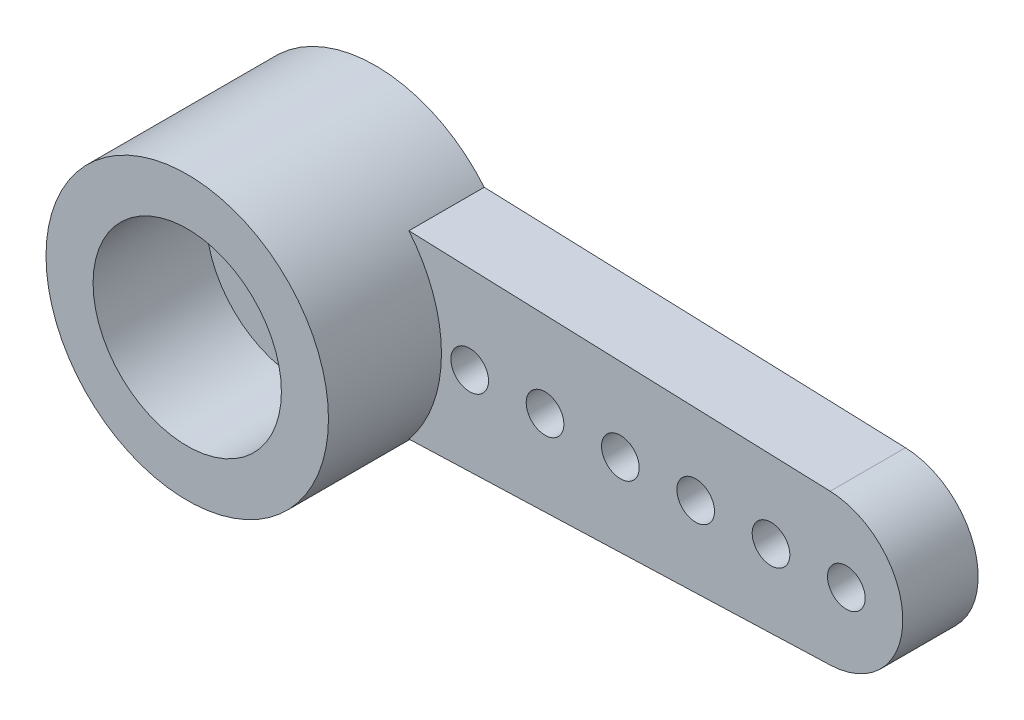
ISO-10303-21;
HEADER;
FILE_DESCRIPTION(('STEP AP214'),'2;1');
FILE_NAME('part.step','',(''),(''),'','','');
FILE_SCHEMA(('AUTOMOTIVE_DESIGN { 1 0 10303 214 1 1 1 1 }'));
ENDSEC;
DATA;
#1=APPLICATION_CONTEXT('core data for automotive mechanical design processes');
#2=APPLICATION_PROTOCOL_DEFINITION('international standard','automotive_design',2000,#1);
#3=PRODUCT_CONTEXT('',#1,'mechanical');
#4=PRODUCT('Part','Part','',(#3));
#5=PRODUCT_RELATED_PRODUCT_CATEGORY('part','',(#4));
#6=PRODUCT_DEFINITION_FORMATION('','',#4);
#7=PRODUCT_DEFINITION_CONTEXT('part definition',#1,'design');
#8=PRODUCT_DEFINITION('design','',#6,#7);
#9=PRODUCT_DEFINITION_SHAPE('','',#8);
#10=(LENGTH_UNIT() NAMED_UNIT(*) SI_UNIT(.MILLI.,.METRE.));
#11=(NAMED_UNIT(*) PLANE_ANGLE_UNIT() SI_UNIT($,.RADIAN.));
#12=(NAMED_UNIT(*) SI_UNIT($,.STERADIAN.) SOLID_ANGLE_UNIT());
#13=UNCERTAINTY_MEASURE_WITH_UNIT(LENGTH_MEASURE(1.E-05),#10,'distance_accuracy_value','');
#14=(GEOMETRIC_REPRESENTATION_CONTEXT(3) GLOBAL_UNCERTAINTY_ASSIGNED_CONTEXT((#13)) GLOBAL_UNIT_ASSIGNED_CONTEXT((#10,
#11,#12)) REPRESENTATION_CONTEXT('',''));
#15=CARTESIAN_POINT('',(0.,0.,0.));
#16=DIRECTION('',(0.,0.,1.));
#17=DIRECTION('',(1.,0.,0.));
#18=AXIS2_PLACEMENT_3D('',#15,#16,#17);
#19=CARTESIAN_POINT('',(0.,0.,0.));
#20=DIRECTION('',(0.,0.,1.));
#21=DIRECTION('',(1.,0.,0.));
#22=AXIS2_PLACEMENT_3D('',#19,#20,#21);
#23=CYLINDRICAL_SURFACE('',#22,2.5);
#24=CARTESIAN_POINT('',(0.,0.,5.));
#25=DIRECTION('',(0.,0.,1.));
#26=DIRECTION('',(1.,0.,0.));
#27=AXIS2_PLACEMENT_3D('',#24,#25,#26);
#28=CIRCLE('',#27,2.5);
#29=CARTESIAN_POINT('',(2.5,0.,5.));
#30=VERTEX_POINT('',#29);
#31=EDGE_CURVE('E236',#30,#30,#28,.T.);
#32=ORIENTED_EDGE('',*,*,#31,.T.);
#33=EDGE_LOOP('',(#32));
#34=FACE_BOUND('',#33,.T.);
#35=DIRECTION('',(0.,0.,-1.));
#36=VECTOR('',#35,1.);
#37=CARTESIAN_POINT('',(-0.233236000127276,2.48909641602021,2.));
#38=LINE('',#37,#36);
#39=CARTESIAN_POINT('',(-0.233236000127276,2.4890964160202,2.));
#40=VERTEX_POINT('',#39);
#41=CARTESIAN_POINT('',(-0.233236000127276,2.4890964160202,1.));
#42=VERTEX_POINT('',#41);
#43=EDGE_CURVE('E135',#40,#42,#38,.T.);
#44=ORIENTED_EDGE('',*,*,#43,.T.);
#45=CARTESIAN_POINT('',(0.,0.,1.));
#46=DIRECTION('',(0.,0.,-1.));
#47=DIRECTION('',(-1.,0.,0.));
#48=AXIS2_PLACEMENT_3D('',#45,#46,#47);
#49=CIRCLE('',#48,2.5);
#50=CARTESIAN_POINT('',(0.233236000127281,2.4890964160202,1.));
#51=VERTEX_POINT('',#50);
#52=EDGE_CURVE('E70',#42,#51,#49,.T.);
#53=ORIENTED_EDGE('',*,*,#52,.T.);
#54=DIRECTION('',(0.,0.,-1.));
#55=VECTOR('',#54,1.);
#56=CARTESIAN_POINT('',(0.233236000127275,2.48909641602021,2.));
#57=LINE('',#56,#55);
#58=CARTESIAN_POINT('',(0.233236000127275,2.4890964160202,2.));
#59=VERTEX_POINT('',#58);
#60=EDGE_CURVE('E132',#59,#51,#57,.T.);
#61=ORIENTED_EDGE('',*,*,#60,.F.);
#62=CARTESIAN_POINT('',(0.,0.,2.));
#63=DIRECTION('',(0.,0.,1.));
#64=DIRECTION('',(1.,0.,0.));
#65=AXIS2_PLACEMENT_3D('',#62,#63,#64);
#66=CIRCLE('',#65,2.5);
#67=CARTESIAN_POINT('',(0.233236000127268,-2.48909641602021,2.));
#68=VERTEX_POINT('',#67);
#69=EDGE_CURVE('E148',#68,#59,#66,.T.);
#70=ORIENTED_EDGE('',*,*,#69,.F.);
#71=DIRECTION('',(0.,0.,-1.));
#72=VECTOR('',#71,1.);
#73=CARTESIAN_POINT('',(0.233236000127268,-2.48909641602021,2.));
#74=LINE('',#73,#72);
#75=CARTESIAN_POINT('',(0.233236000127268,-2.48909641602021,1.));
#76=VERTEX_POINT('',#75);
#77=EDGE_CURVE('E139',#68,#76,#74,.T.);
#78=ORIENTED_EDGE('',*,*,#77,.T.);
#79=CARTESIAN_POINT('',(-0.233236000127282,-2.4890964160202,1.));
#80=VERTEX_POINT('',#79);
#81=EDGE_CURVE('E62',#76,#80,#49,.T.);
#82=ORIENTED_EDGE('',*,*,#81,.T.);
#83=DIRECTION('',(0.,0.,-1.));
#84=VECTOR('',#83,1.);
#85=CARTESIAN_POINT('',(-0.233236000127276,-2.48909641602021,2.));
#86=LINE('',#85,#84);
#87=CARTESIAN_POINT('',(-0.233236000127276,-2.4890964160202,2.));
#88=VERTEX_POINT('',#87);
#89=EDGE_CURVE('E166',#88,#80,#86,.T.);
#90=ORIENTED_EDGE('',*,*,#89,.F.);
#91=EDGE_CURVE('E164',#40,#88,#66,.T.);
#92=ORIENTED_EDGE('',*,*,#91,.F.);
#93=EDGE_LOOP('',(#44,#53,#61,#70,#78,#82,#90,#92));
#94=FACE_BOUND('',#93,.T.);
#95=ADVANCED_FACE('F47',(#34,#94),#23,.F.);
#96=CARTESIAN_POINT('',(-0.088385880769583,-2.49422934631706,2.));
#97=DIRECTION('',(0.0354139201848025,0.999372730394994,0.));
#98=DIRECTION('',(-0.999372730394994,0.0354139201848025,0.));
#99=AXIS2_PLACEMENT_3D('',#96,#97,#98);
#100=PLANE('',#99);
#101=DIRECTION('',(-0.999372730394994,0.0354139201848025,0.));
#102=VECTOR('',#101,1.);
#103=CARTESIAN_POINT('',(-0.088385880769583,-2.49422934631706,1.));
#104=LINE('',#103,#102);
#105=CARTESIAN_POINT('',(0.,-2.4973614014871,1.));
#106=VERTEX_POINT('',#105);
#107=EDGE_CURVE('E273',#106,#80,#104,.T.);
#108=ORIENTED_EDGE('',*,*,#107,.F.);
#109=DIRECTION('',(0.,0.,-1.));
#110=VECTOR('',#109,1.);
#111=CARTESIAN_POINT('',(0.,-2.4973614014871,2.));
#112=LINE('',#111,#110);
#113=CARTESIAN_POINT('',(0.,-2.4973614014871,2.));
#114=VERTEX_POINT('',#113);
#115=EDGE_CURVE('E143',#114,#106,#112,.T.);
#116=ORIENTED_EDGE('',*,*,#115,.F.);
#117=DIRECTION('',(0.999372730394994,-0.0354139201848025,0.));
#118=VECTOR('',#117,1.);
#119=CARTESIAN_POINT('',(-0.088385880769583,-2.49422934631706,2.));
#120=LINE('',#119,#118);
#121=EDGE_CURVE('E161',#88,#114,#120,.T.);
#122=ORIENTED_EDGE('',*,*,#121,.F.);
#123=ORIENTED_EDGE('',*,*,#89,.T.);
#124=EDGE_LOOP('',(#108,#116,#122,#123));
#125=FACE_BOUND('',#124,.T.);
#126=ADVANCED_FACE('F338',(#125),#100,.F.);
#127=CARTESIAN_POINT('',(0.0883858807695838,-2.49422934631706,2.));
#128=DIRECTION('',(0.0354139201848029,-0.999372730394994,0.));
#129=DIRECTION('',(0.999372730394994,0.0354139201848029,0.));
#130=AXIS2_PLACEMENT_3D('',#127,#128,#129);
#131=PLANE('',#130);
#132=ORIENTED_EDGE('',*,*,#115,.T.);
#133=DIRECTION('',(0.999372730394994,0.0354139201848029,0.));
#134=VECTOR('',#133,1.);
#135=CARTESIAN_POINT('',(0.0883858807695838,-2.49422934631706,1.));
#136=LINE('',#135,#134);
#137=EDGE_CURVE('E127',#106,#76,#136,.T.);
#138=ORIENTED_EDGE('',*,*,#137,.T.);
#139=ORIENTED_EDGE('',*,*,#77,.F.);
#140=DIRECTION('',(-0.999372730394994,-0.0354139201848029,0.));
#141=VECTOR('',#140,1.);
#142=CARTESIAN_POINT('',(0.0883858807695838,-2.49422934631706,2.));
#143=LINE('',#142,#141);
#144=EDGE_CURVE('E154',#68,#114,#143,.T.);
#145=ORIENTED_EDGE('',*,*,#144,.T.);
#146=EDGE_LOOP('',(#132,#138,#139,#145));
#147=FACE_BOUND('',#146,.T.);
#148=ADVANCED_FACE('F344',(#147),#131,.T.);
#149=CARTESIAN_POINT('',(0.0883858807695825,2.49422934631706,2.));
#150=DIRECTION('',(-0.0354139201848023,-0.999372730394994,0.));
#151=DIRECTION('',(0.999372730394994,-0.0354139201848023,0.));
#152=AXIS2_PLACEMENT_3D('',#149,#150,#151);
#153=PLANE('',#152);
#154=DIRECTION('',(0.999372730394994,-0.0354139201848023,0.));
#155=VECTOR('',#154,1.);
#156=CARTESIAN_POINT('',(0.0883858807695825,2.49422934631706,1.));
#157=LINE('',#156,#155);
#158=CARTESIAN_POINT('',(0.,2.4973614014871,1.));
#159=VERTEX_POINT('',#158);
#160=EDGE_CURVE('E121',#159,#51,#157,.T.);
#161=ORIENTED_EDGE('',*,*,#160,.F.);
#162=DIRECTION('',(0.,0.,-1.));
#163=VECTOR('',#162,1.);
#164=CARTESIAN_POINT('',(0.,2.4973614014871,2.));
#165=LINE('',#164,#163);
#166=CARTESIAN_POINT('',(0.,2.4973614014871,2.));
#167=VERTEX_POINT('',#166);
#168=EDGE_CURVE('E140',#167,#159,#165,.T.);
#169=ORIENTED_EDGE('',*,*,#168,.F.);
#170=DIRECTION('',(-0.999372730394994,0.0354139201848023,0.));
#171=VECTOR('',#170,1.);
#172=CARTESIAN_POINT('',(0.0883858807695825,2.49422934631706,2.));
#173=LINE('',#172,#171);
#174=EDGE_CURVE('E138',#59,#167,#173,.T.);
#175=ORIENTED_EDGE('',*,*,#174,.F.);
#176=ORIENTED_EDGE('',*,*,#60,.T.);
#177=EDGE_LOOP('',(#161,#169,#175,#176));
#178=FACE_BOUND('',#177,.T.);
#179=ADVANCED_FACE('F137',(#178),#153,.F.);
#180=CARTESIAN_POINT('',(-0.088385880769583,2.49422934631706,2.));
#181=DIRECTION('',(-0.0354139201848025,0.999372730394994,0.));
#182=DIRECTION('',(-0.999372730394994,-0.0354139201848025,0.));
#183=AXIS2_PLACEMENT_3D('',#180,#181,#182);
#184=PLANE('',#183);
#185=ORIENTED_EDGE('',*,*,#168,.T.);
#186=DIRECTION('',(-0.999372730394994,-0.0354139201848025,0.));
#187=VECTOR('',#186,1.);
#188=CARTESIAN_POINT('',(-0.088385880769583,2.49422934631706,1.));
#189=LINE('',#188,#187);
#190=EDGE_CURVE('E12',#159,#42,#189,.T.);
#191=ORIENTED_EDGE('',*,*,#190,.T.);
#192=ORIENTED_EDGE('',*,*,#43,.F.);
#193=DIRECTION('',(0.999372730394994,0.0354139201848026,0.));
#194=VECTOR('',#193,1.);
#195=CARTESIAN_POINT('',(-0.088385880769583,2.49422934631706,2.));
#196=LINE('',#195,#194);
#197=EDGE_CURVE('E153',#40,#167,#196,.T.);
#198=ORIENTED_EDGE('',*,*,#197,.T.);
#199=EDGE_LOOP('',(#185,#191,#192,#198));
#200=FACE_BOUND('',#199,.T.);
#201=ADVANCED_FACE('F366',(#200),#184,.T.);
#202=CARTESIAN_POINT('',(0.,0.,2.));
#203=DIRECTION('',(0.,0.,1.));
#204=DIRECTION('',(1.,0.,0.));
#205=AXIS2_PLACEMENT_3D('',#202,#203,#204);
#206=PLANE('',#205);
#207=CARTESIAN_POINT('',(0.,0.,2.));
#208=DIRECTION('',(0.,0.,1.));
#209=DIRECTION('',(1.,0.,0.));
#210=AXIS2_PLACEMENT_3D('',#207,#208,#209);
#211=CIRCLE('',#210,1.25);
#212=CARTESIAN_POINT('',(1.25,0.,2.));
#213=VERTEX_POINT('',#212);
#214=EDGE_CURVE('E282',#213,#213,#211,.T.);
#215=ORIENTED_EDGE('',*,*,#214,.F.);
#216=EDGE_LOOP('',(#215));
#217=FACE_BOUND('',#216,.T.);
#218=ORIENTED_EDGE('',*,*,#197,.F.);
#219=ORIENTED_EDGE('',*,*,#91,.T.);
#220=ORIENTED_EDGE('',*,*,#121,.T.);
#221=ORIENTED_EDGE('',*,*,#144,.F.);
#222=ORIENTED_EDGE('',*,*,#69,.T.);
#223=ORIENTED_EDGE('',*,*,#174,.T.);
#224=EDGE_LOOP('',(#218,#219,#220,#221,#222,#223));
#225=FACE_BOUND('',#224,.T.);
#226=ADVANCED_FACE('F354',(#217,#225),#206,.T.);
#227=CARTESIAN_POINT('',(0.0883858807695838,-2.49422934631706,2.));
#228=DIRECTION('',(0.0354139201848029,-0.999372730394994,0.));
#229=DIRECTION('',(0.999372730394994,0.0354139201848029,0.));
#230=AXIS2_PLACEMENT_3D('',#227,#228,#229);
#231=PLANE('',#230);
#232=DIRECTION('',(-0.999372730394994,-0.0354139201848029,0.));
#233=VECTOR('',#232,1.);
#234=CARTESIAN_POINT('',(0.0883858807695838,-2.49422934631706,0.));
#235=LINE('',#234,#233);
#236=CARTESIAN_POINT('',(14.0708278403696,-1.99874546078998,0.));
#237=VERTEX_POINT('',#236);
#238=CARTESIAN_POINT('',(2.88547071027724,-2.39511143376089,0.));
#239=VERTEX_POINT('',#238);
#240=EDGE_CURVE('E202',#237,#239,#235,.T.);
#241=ORIENTED_EDGE('',*,*,#240,.F.);
#242=DIRECTION('',(0.,0.,-1.));
#243=VECTOR('',#242,1.);
#244=CARTESIAN_POINT('',(14.0708278403696,-1.99874546078998,2.));
#245=LINE('',#244,#243);
#246=CARTESIAN_POINT('',(14.0708278403696,-1.99874546078998,2.));
#247=VERTEX_POINT('',#246);
#248=EDGE_CURVE('E173',#247,#237,#245,.T.);
#249=ORIENTED_EDGE('',*,*,#248,.F.);
#250=DIRECTION('',(-0.999372730394994,-0.0354139201848029,0.));
#251=VECTOR('',#250,1.);
#252=CARTESIAN_POINT('',(0.0883858807695838,-2.49422934631706,2.));
#253=LINE('',#252,#251);
#254=CARTESIAN_POINT('',(2.88547071027724,-2.39511143376089,2.));
#255=VERTEX_POINT('',#254);
#256=EDGE_CURVE('E188',#247,#255,#253,.T.);
#257=ORIENTED_EDGE('',*,*,#256,.T.);
#258=DIRECTION('',(0.,0.,-1.));
#259=VECTOR('',#258,1.);
#260=CARTESIAN_POINT('',(2.88547071027724,-2.39511143376089,2.));
#261=LINE('',#260,#259);
#262=EDGE_CURVE('E181',#255,#239,#261,.T.);
#263=ORIENTED_EDGE('',*,*,#262,.T.);
#264=EDGE_LOOP('',(#241,#249,#257,#263));
#265=FACE_BOUND('',#264,.T.);
#266=ADVANCED_FACE('F49',(#265),#231,.T.);
#267=CARTESIAN_POINT('',(14.,0.,2.));
#268=DIRECTION('',(0.,0.,-1.));
#269=DIRECTION('',(-1.,0.,0.));
#270=AXIS2_PLACEMENT_3D('',#267,#268,#269);
#271=CYLINDRICAL_SURFACE('',#270,2.);
#272=CARTESIAN_POINT('',(14.,0.,0.));
#273=DIRECTION('',(0.,0.,1.));
#274=DIRECTION('',(1.,0.,0.));
#275=AXIS2_PLACEMENT_3D('',#272,#273,#274);
#276=CIRCLE('',#275,2.);
#277=CARTESIAN_POINT('',(14.0708278403696,1.99874546078999,0.));
#278=VERTEX_POINT('',#277);
#279=EDGE_CURVE('E197',#237,#278,#276,.T.);
#280=ORIENTED_EDGE('',*,*,#279,.T.);
#281=DIRECTION('',(0.,0.,-1.));
#282=VECTOR('',#281,1.);
#283=CARTESIAN_POINT('',(14.0708278403696,1.99874546078999,2.));
#284=LINE('',#283,#282);
#285=CARTESIAN_POINT('',(14.0708278403696,1.99874546078999,2.));
#286=VERTEX_POINT('',#285);
#287=EDGE_CURVE('E205',#286,#278,#284,.T.);
#288=ORIENTED_EDGE('',*,*,#287,.F.);
#289=CARTESIAN_POINT('',(14.,0.,2.));
#290=DIRECTION('',(0.,0.,1.));
#291=DIRECTION('',(1.,0.,0.));
#292=AXIS2_PLACEMENT_3D('',#289,#290,#291);
#293=CIRCLE('',#292,2.);
#294=EDGE_CURVE('E190',#247,#286,#293,.T.);
#295=ORIENTED_EDGE('',*,*,#294,.F.);
#296=ORIENTED_EDGE('',*,*,#248,.T.);
#297=EDGE_LOOP('',(#280,#288,#295,#296));
#298=FACE_BOUND('',#297,.T.);
#299=ADVANCED_FACE('F357',(#298),#271,.T.);
#300=CARTESIAN_POINT('',(0.0883858807695825,2.49422934631706,2.));
#301=DIRECTION('',(-0.0354139201848023,-0.999372730394994,0.));
#302=DIRECTION('',(0.999372730394994,-0.0354139201848023,0.));
#303=AXIS2_PLACEMENT_3D('',#300,#301,#302);
#304=PLANE('',#303);
#305=DIRECTION('',(-0.999372730394994,0.0354139201848023,0.));
#306=VECTOR('',#305,1.);
#307=CARTESIAN_POINT('',(0.0883858807695825,2.49422934631706,0.));
#308=LINE('',#307,#306);
#309=CARTESIAN_POINT('',(2.88547071027724,2.39511143376089,0.));
#310=VERTEX_POINT('',#309);
#311=EDGE_CURVE('E191',#278,#310,#308,.T.);
#312=ORIENTED_EDGE('',*,*,#311,.T.);
#313=DIRECTION('',(0.,0.,-1.));
#314=VECTOR('',#313,1.);
#315=CARTESIAN_POINT('',(2.88547071027724,2.39511143376089,2.));
#316=LINE('',#315,#314);
#317=CARTESIAN_POINT('',(2.88547071027724,2.39511143376089,2.));
#318=VERTEX_POINT('',#317);
#319=EDGE_CURVE('E184',#318,#310,#316,.T.);
#320=ORIENTED_EDGE('',*,*,#319,.F.);
#321=DIRECTION('',(-0.999372730394994,0.0354139201848023,0.));
#322=VECTOR('',#321,1.);
#323=CARTESIAN_POINT('',(0.0883858807695825,2.49422934631706,2.));
#324=LINE('',#323,#322);
#325=EDGE_CURVE('E185',#286,#318,#324,.T.);
#326=ORIENTED_EDGE('',*,*,#325,.F.);
#327=ORIENTED_EDGE('',*,*,#287,.T.);
#328=EDGE_LOOP('',(#312,#320,#326,#327));
#329=FACE_BOUND('',#328,.T.);
#330=ADVANCED_FACE('F352',(#329),#304,.F.);
#331=CARTESIAN_POINT('',(12.5,0.,2.));
#332=DIRECTION('',(0.,0.,-1.));
#333=DIRECTION('',(-1.,0.,0.));
#334=AXIS2_PLACEMENT_3D('',#331,#332,#333);
#335=CIRCLE('',#334,0.500000000000001);
#336=CARTESIAN_POINT('',(12.,0.,2.));
#337=VERTEX_POINT('',#336);
#338=EDGE_CURVE('E270',#337,#337,#335,.T.);
#339=ORIENTED_EDGE('',*,*,#338,.T.);
#340=EDGE_LOOP('',(#339));
#341=FACE_BOUND('',#340,.T.);
#342=CARTESIAN_POINT('',(4.5,0.,2.));
#343=DIRECTION('',(0.,0.,-1.));
#344=DIRECTION('',(-1.,0.,0.));
#345=AXIS2_PLACEMENT_3D('',#342,#343,#344);
#346=CIRCLE('',#345,0.500000000000001);
#347=CARTESIAN_POINT('',(4.,0.,2.));
#348=VERTEX_POINT('',#347);
#349=EDGE_CURVE('E264',#348,#348,#346,.T.);
#350=ORIENTED_EDGE('',*,*,#349,.T.);
#351=EDGE_LOOP('',(#350));
#352=FACE_BOUND('',#351,.T.);
#353=CARTESIAN_POINT('',(6.5,0.,2.));
#354=DIRECTION('',(0.,0.,-1.));
#355=DIRECTION('',(-1.,0.,0.));
#356=AXIS2_PLACEMENT_3D('',#353,#354,#355);
#357=CIRCLE('',#356,0.500000000000001);
#358=CARTESIAN_POINT('',(6.,0.,2.));
#359=VERTEX_POINT('',#358);
#360=EDGE_CURVE('E258',#359,#359,#357,.T.);
#361=ORIENTED_EDGE('',*,*,#360,.T.);
#362=EDGE_LOOP('',(#361));
#363=FACE_BOUND('',#362,.T.);
#364=CARTESIAN_POINT('',(8.5,0.,2.));
#365=DIRECTION('',(0.,0.,-1.));
#366=DIRECTION('',(-1.,0.,0.));
#367=AXIS2_PLACEMENT_3D('',#364,#365,#366);
#368=CIRCLE('',#367,0.500000000000001);
#369=CARTESIAN_POINT('',(8.,0.,2.));
#370=VERTEX_POINT('',#369);
#371=EDGE_CURVE('E252',#370,#370,#368,.T.);
#372=ORIENTED_EDGE('',*,*,#371,.T.);
#373=EDGE_LOOP('',(#372));
#374=FACE_BOUND('',#373,.T.);
#375=CARTESIAN_POINT('',(10.5,0.,2.));
#376=DIRECTION('',(0.,0.,-1.));
#377=DIRECTION('',(-1.,0.,0.));
#378=AXIS2_PLACEMENT_3D('',#375,#376,#377);
#379=CIRCLE('',#378,0.500000000000001);
#380=CARTESIAN_POINT('',(10.,0.,2.));
#381=VERTEX_POINT('',#380);
#382=EDGE_CURVE('E246',#381,#381,#379,.T.);
#383=ORIENTED_EDGE('',*,*,#382,.T.);
#384=EDGE_LOOP('',(#383));
#385=FACE_BOUND('',#384,.T.);
#386=CARTESIAN_POINT('',(14.5,0.,2.));
#387=DIRECTION('',(0.,0.,-1.));
#388=DIRECTION('',(-1.,0.,0.));
#389=AXIS2_PLACEMENT_3D('',#386,#387,#388);
#390=CIRCLE('',#389,0.500000000000001);
#391=CARTESIAN_POINT('',(14.,0.,2.));
#392=VERTEX_POINT('',#391);
#393=EDGE_CURVE('E239',#392,#392,#390,.T.);
#394=ORIENTED_EDGE('',*,*,#393,.T.);
#395=EDGE_LOOP('',(#394));
#396=FACE_BOUND('',#395,.T.);
#397=CARTESIAN_POINT('',(0.,0.,2.));
#398=DIRECTION('',(0.,0.,1.));
#399=DIRECTION('',(1.,0.,0.));
#400=AXIS2_PLACEMENT_3D('',#397,#398,#399);
#401=CIRCLE('',#400,3.75);
#402=EDGE_CURVE('E55',#255,#318,#401,.T.);
#403=ORIENTED_EDGE('',*,*,#402,.F.);
#404=ORIENTED_EDGE('',*,*,#256,.F.);
#405=ORIENTED_EDGE('',*,*,#294,.T.);
#406=ORIENTED_EDGE('',*,*,#325,.T.);
#407=EDGE_LOOP('',(#403,#404,#405,#406));
#408=FACE_BOUND('',#407,.T.);
#409=ADVANCED_FACE('F218',(#341,#352,#363,#374,#385,#396,#408),#206,.T.);
#410=CARTESIAN_POINT('',(0.,0.,0.));
#411=DIRECTION('',(0.,0.,1.));
#412=DIRECTION('',(1.,0.,0.));
#413=AXIS2_PLACEMENT_3D('',#410,#411,#412);
#414=PLANE('',#413);
#415=CARTESIAN_POINT('',(0.,0.,0.));
#416=DIRECTION('',(0.,0.,-1.));
#417=DIRECTION('',(-1.,0.,0.));
#418=AXIS2_PLACEMENT_3D('',#415,#416,#417);
#419=CIRCLE('',#418,2.5);
#420=CARTESIAN_POINT('',(-2.5,0.,0.));
#421=VERTEX_POINT('',#420);
#422=EDGE_CURVE('E278',#421,#421,#419,.T.);
#423=ORIENTED_EDGE('',*,*,#422,.F.);
#424=EDGE_LOOP('',(#423));
#425=FACE_BOUND('',#424,.T.);
#426=CARTESIAN_POINT('',(12.5,0.,0.));
#427=DIRECTION('',(0.,0.,-1.));
#428=DIRECTION('',(-1.,0.,0.));
#429=AXIS2_PLACEMENT_3D('',#426,#427,#428);
#430=CIRCLE('',#429,0.500000000000001);
#431=CARTESIAN_POINT('',(12.,0.,0.));
#432=VERTEX_POINT('',#431);
#433=EDGE_CURVE('E267',#432,#432,#430,.T.);
#434=ORIENTED_EDGE('',*,*,#433,.F.);
#435=EDGE_LOOP('',(#434));
#436=FACE_BOUND('',#435,.T.);
#437=CARTESIAN_POINT('',(4.5,0.,0.));
#438=DIRECTION('',(0.,0.,-1.));
#439=DIRECTION('',(-1.,0.,0.));
#440=AXIS2_PLACEMENT_3D('',#437,#438,#439);
#441=CIRCLE('',#440,0.500000000000001);
#442=CARTESIAN_POINT('',(4.,0.,0.));
#443=VERTEX_POINT('',#442);
#444=EDGE_CURVE('E261',#443,#443,#441,.T.);
#445=ORIENTED_EDGE('',*,*,#444,.F.);
#446=EDGE_LOOP('',(#445));
#447=FACE_BOUND('',#446,.T.);
#448=CARTESIAN_POINT('',(6.5,0.,0.));
#449=DIRECTION('',(0.,0.,-1.));
#450=DIRECTION('',(-1.,0.,0.));
#451=AXIS2_PLACEMENT_3D('',#448,#449,#450);
#452=CIRCLE('',#451,0.500000000000001);
#453=CARTESIAN_POINT('',(6.,0.,0.));
#454=VERTEX_POINT('',#453);
#455=EDGE_CURVE('E255',#454,#454,#452,.T.);
#456=ORIENTED_EDGE('',*,*,#455,.F.);
#457=EDGE_LOOP('',(#456));
#458=FACE_BOUND('',#457,.T.);
#459=CARTESIAN_POINT('',(8.5,0.,0.));
#460=DIRECTION('',(0.,0.,-1.));
#461=DIRECTION('',(-1.,0.,0.));
#462=AXIS2_PLACEMENT_3D('',#459,#460,#461);
#463=CIRCLE('',#462,0.500000000000001);
#464=CARTESIAN_POINT('',(8.,0.,0.));
#465=VERTEX_POINT('',#464);
#466=EDGE_CURVE('E249',#465,#465,#463,.T.);
#467=ORIENTED_EDGE('',*,*,#466,.F.);
#468=EDGE_LOOP('',(#467));
#469=FACE_BOUND('',#468,.T.);
#470=CARTESIAN_POINT('',(10.5,0.,0.));
#471=DIRECTION('',(0.,0.,-1.));
#472=DIRECTION('',(-1.,0.,0.));
#473=AXIS2_PLACEMENT_3D('',#470,#471,#472);
#474=CIRCLE('',#473,0.500000000000001);
#475=CARTESIAN_POINT('',(10.,0.,0.));
#476=VERTEX_POINT('',#475);
#477=EDGE_CURVE('E243',#476,#476,#474,.T.);
#478=ORIENTED_EDGE('',*,*,#477,.F.);
#479=EDGE_LOOP('',(#478));
#480=FACE_BOUND('',#479,.T.);
#481=CARTESIAN_POINT('',(14.5,0.,0.));
#482=DIRECTION('',(0.,0.,-1.));
#483=DIRECTION('',(-1.,0.,0.));
#484=AXIS2_PLACEMENT_3D('',#481,#482,#483);
#485=CIRCLE('',#484,0.500000000000001);
#486=CARTESIAN_POINT('',(14.,0.,0.));
#487=VERTEX_POINT('',#486);
#488=EDGE_CURVE('E240',#487,#487,#485,.T.);
#489=ORIENTED_EDGE('',*,*,#488,.F.);
#490=EDGE_LOOP('',(#489));
#491=FACE_BOUND('',#490,.T.);
#492=ORIENTED_EDGE('',*,*,#240,.T.);
#493=CARTESIAN_POINT('',(0.,0.,0.));
#494=DIRECTION('',(0.,0.,-1.));
#495=DIRECTION('',(-1.,0.,0.));
#496=AXIS2_PLACEMENT_3D('',#493,#494,#495);
#497=CIRCLE('',#496,3.75);
#498=EDGE_CURVE('E223',#239,#310,#497,.T.);
#499=ORIENTED_EDGE('',*,*,#498,.T.);
#500=ORIENTED_EDGE('',*,*,#311,.F.);
#501=ORIENTED_EDGE('',*,*,#279,.F.);
#502=EDGE_LOOP('',(#492,#499,#500,#501));
#503=FACE_BOUND('',#502,.T.);
#504=ADVANCED_FACE('F228',(#425,#436,#447,#458,#469,#480,#491,#503),#414,.F.);
#505=CARTESIAN_POINT('',(0.,0.,0.));
#506=DIRECTION('',(0.,0.,1.));
#507=DIRECTION('',(1.,0.,0.));
#508=AXIS2_PLACEMENT_3D('',#505,#506,#507);
#509=CYLINDRICAL_SURFACE('',#508,3.75);
#510=ORIENTED_EDGE('',*,*,#262,.F.);
#511=ORIENTED_EDGE('',*,*,#402,.T.);
#512=ORIENTED_EDGE('',*,*,#319,.T.);
#513=ORIENTED_EDGE('',*,*,#498,.F.);
#514=EDGE_LOOP('',(#510,#511,#512,#513));
#515=FACE_BOUND('',#514,.T.);
#516=CARTESIAN_POINT('',(0.,0.,5.));
#517=DIRECTION('',(0.,0.,1.));
#518=DIRECTION('',(1.,0.,0.));
#519=AXIS2_PLACEMENT_3D('',#516,#517,#518);
#520=CIRCLE('',#519,3.75);
#521=CARTESIAN_POINT('',(3.75,0.,5.));
#522=VERTEX_POINT('',#521);
#523=EDGE_CURVE('E233',#522,#522,#520,.T.);
#524=ORIENTED_EDGE('',*,*,#523,.F.);
#525=EDGE_LOOP('',(#524));
#526=FACE_BOUND('',#525,.T.);
#527=ADVANCED_FACE('F221',(#515,#526),#509,.T.);
#528=CARTESIAN_POINT('',(0.,0.,5.));
#529=DIRECTION('',(0.,0.,1.));
#530=DIRECTION('',(1.,0.,0.));
#531=AXIS2_PLACEMENT_3D('',#528,#529,#530);
#532=PLANE('',#531);
#533=ORIENTED_EDGE('',*,*,#523,.T.);
#534=EDGE_LOOP('',(#533));
#535=FACE_BOUND('',#534,.T.);
#536=ORIENTED_EDGE('',*,*,#31,.F.);
#537=EDGE_LOOP('',(#536));
#538=FACE_BOUND('',#537,.T.);
#539=ADVANCED_FACE('F324',(#535,#538),#532,.T.);
#540=CARTESIAN_POINT('',(14.5,0.,2.));
#541=DIRECTION('',(0.,0.,-1.));
#542=DIRECTION('',(-1.,0.,0.));
#543=AXIS2_PLACEMENT_3D('',#540,#541,#542);
#544=CYLINDRICAL_SURFACE('',#543,0.500000000000001);
#545=ORIENTED_EDGE('',*,*,#393,.F.);
#546=EDGE_LOOP('',(#545));
#547=FACE_BOUND('',#546,.T.);
#548=ORIENTED_EDGE('',*,*,#488,.T.);
#549=EDGE_LOOP('',(#548));
#550=FACE_BOUND('',#549,.T.);
#551=ADVANCED_FACE('F321',(#547,#550),#544,.F.);
#552=CARTESIAN_POINT('',(10.5,0.,2.));
#553=DIRECTION('',(0.,0.,-1.));
#554=DIRECTION('',(-1.,0.,0.));
#555=AXIS2_PLACEMENT_3D('',#552,#553,#554);
#556=CYLINDRICAL_SURFACE('',#555,0.500000000000001);
#557=ORIENTED_EDGE('',*,*,#382,.F.);
#558=EDGE_LOOP('',(#557));
#559=FACE_BOUND('',#558,.T.);
#560=ORIENTED_EDGE('',*,*,#477,.T.);
#561=EDGE_LOOP('',(#560));
#562=FACE_BOUND('',#561,.T.);
#563=ADVANCED_FACE('F323',(#559,#562),#556,.F.);
#564=CARTESIAN_POINT('',(8.5,0.,2.));
#565=DIRECTION('',(0.,0.,-1.));
#566=DIRECTION('',(-1.,0.,0.));
#567=AXIS2_PLACEMENT_3D('',#564,#565,#566);
#568=CYLINDRICAL_SURFACE('',#567,0.500000000000001);
#569=ORIENTED_EDGE('',*,*,#371,.F.);
#570=EDGE_LOOP('',(#569));
#571=FACE_BOUND('',#570,.T.);
#572=ORIENTED_EDGE('',*,*,#466,.T.);
#573=EDGE_LOOP('',(#572));
#574=FACE_BOUND('',#573,.T.);
#575=ADVANCED_FACE('F331',(#571,#574),#568,.F.);
#576=CARTESIAN_POINT('',(6.5,0.,2.));
#577=DIRECTION('',(0.,0.,-1.));
#578=DIRECTION('',(-1.,0.,0.));
#579=AXIS2_PLACEMENT_3D('',#576,#577,#578);
#580=CYLINDRICAL_SURFACE('',#579,0.500000000000001);
#581=ORIENTED_EDGE('',*,*,#360,.F.);
#582=EDGE_LOOP('',(#581));
#583=FACE_BOUND('',#582,.T.);
#584=ORIENTED_EDGE('',*,*,#455,.T.);
#585=EDGE_LOOP('',(#584));
#586=FACE_BOUND('',#585,.T.);
#587=ADVANCED_FACE('F405',(#583,#586),#580,.F.);
#588=CARTESIAN_POINT('',(4.5,0.,2.));
#589=DIRECTION('',(0.,0.,-1.));
#590=DIRECTION('',(-1.,0.,0.));
#591=AXIS2_PLACEMENT_3D('',#588,#589,#590);
#592=CYLINDRICAL_SURFACE('',#591,0.500000000000001);
#593=ORIENTED_EDGE('',*,*,#349,.F.);
#594=EDGE_LOOP('',(#593));
#595=FACE_BOUND('',#594,.T.);
#596=ORIENTED_EDGE('',*,*,#444,.T.);
#597=EDGE_LOOP('',(#596));
#598=FACE_BOUND('',#597,.T.);
#599=ADVANCED_FACE('F401',(#595,#598),#592,.F.);
#600=CARTESIAN_POINT('',(12.5,0.,2.));
#601=DIRECTION('',(0.,0.,-1.));
#602=DIRECTION('',(-1.,0.,0.));
#603=AXIS2_PLACEMENT_3D('',#600,#601,#602);
#604=CYLINDRICAL_SURFACE('',#603,0.500000000000001);
#605=ORIENTED_EDGE('',*,*,#338,.F.);
#606=EDGE_LOOP('',(#605));
#607=FACE_BOUND('',#606,.T.);
#608=ORIENTED_EDGE('',*,*,#433,.T.);
#609=EDGE_LOOP('',(#608));
#610=FACE_BOUND('',#609,.T.);
#611=ADVANCED_FACE('F397',(#607,#610),#604,.F.);
#612=CARTESIAN_POINT('',(0.,0.,1.));
#613=DIRECTION('',(0.,0.,-1.));
#614=DIRECTION('',(-1.,0.,0.));
#615=AXIS2_PLACEMENT_3D('',#612,#613,#614);
#616=PLANE('',#615);
#617=ORIENTED_EDGE('',*,*,#190,.F.);
#618=ORIENTED_EDGE('',*,*,#160,.T.);
#619=ORIENTED_EDGE('',*,*,#52,.F.);
#620=EDGE_LOOP('',(#617,#618,#619));
#621=FACE_BOUND('',#620,.T.);
#622=ADVANCED_FACE('F122',(#621),#616,.F.);
#623=ORIENTED_EDGE('',*,*,#137,.F.);
#624=ORIENTED_EDGE('',*,*,#107,.T.);
#625=ORIENTED_EDGE('',*,*,#81,.F.);
#626=EDGE_LOOP('',(#623,#624,#625));
#627=FACE_BOUND('',#626,.T.);
#628=ADVANCED_FACE('F302',(#627),#616,.F.);
#629=CARTESIAN_POINT('',(0.,0.,0.5));
#630=DIRECTION('',(0.,0.,-1.));
#631=DIRECTION('',(-1.,0.,0.));
#632=AXIS2_PLACEMENT_3D('',#629,#630,#631);
#633=CYLINDRICAL_SURFACE('',#632,2.5);
#634=CARTESIAN_POINT('',(0.,0.,0.5));
#635=DIRECTION('',(0.,0.,-1.));
#636=DIRECTION('',(-1.,0.,0.));
#637=AXIS2_PLACEMENT_3D('',#634,#635,#636);
#638=CIRCLE('',#637,2.5);
#639=CARTESIAN_POINT('',(-2.5,0.,0.5));
#640=VERTEX_POINT('',#639);
#641=EDGE_CURVE('E281',#640,#640,#638,.T.);
#642=ORIENTED_EDGE('',*,*,#641,.F.);
#643=EDGE_LOOP('',(#642));
#644=FACE_BOUND('',#643,.T.);
#645=ORIENTED_EDGE('',*,*,#422,.T.);
#646=EDGE_LOOP('',(#645));
#647=FACE_BOUND('',#646,.T.);
#648=ADVANCED_FACE('F296',(#644,#647),#633,.F.);
#649=CARTESIAN_POINT('',(0.,0.,0.5));
#650=DIRECTION('',(0.,0.,-1.));
#651=DIRECTION('',(-1.,0.,0.));
#652=AXIS2_PLACEMENT_3D('',#649,#650,#651);
#653=PLANE('',#652);
#654=CARTESIAN_POINT('',(0.,0.,0.5));
#655=DIRECTION('',(0.,0.,-1.));
#656=DIRECTION('',(-1.,0.,0.));
#657=AXIS2_PLACEMENT_3D('',#654,#655,#656);
#658=CIRCLE('',#657,1.25);
#659=CARTESIAN_POINT('',(-1.25,0.,0.5));
#660=VERTEX_POINT('',#659);
#661=EDGE_CURVE('E287',#660,#660,#658,.T.);
#662=ORIENTED_EDGE('',*,*,#661,.F.);
#663=EDGE_LOOP('',(#662));
#664=FACE_BOUND('',#663,.T.);
#665=ORIENTED_EDGE('',*,*,#641,.T.);
#666=EDGE_LOOP('',(#665));
#667=FACE_BOUND('',#666,.T.);
#668=ADVANCED_FACE('F293',(#664,#667),#653,.T.);
#669=CARTESIAN_POINT('',(0.,0.,5.5));
#670=DIRECTION('',(0.,0.,-1.));
#671=DIRECTION('',(-1.,0.,0.));
#672=AXIS2_PLACEMENT_3D('',#669,#670,#671);
#673=CYLINDRICAL_SURFACE('',#672,1.25);
#674=ORIENTED_EDGE('',*,*,#214,.T.);
#675=EDGE_LOOP('',(#674));
#676=FACE_BOUND('',#675,.T.);
#677=ORIENTED_EDGE('',*,*,#661,.T.);
#678=EDGE_LOOP('',(#677));
#679=FACE_BOUND('',#678,.T.);
#680=ADVANCED_FACE('F291',(#676,#679),#673,.F.);
#681=CLOSED_SHELL('',(#95,#126,#148,#179,#201,#226,#266,#299,#330,#409,#504,#527,#539,#551,#563,
#575,#587,#599,#611,#622,#628,#648,#668,#680));
#682=MANIFOLD_SOLID_BREP('B2',#681);
#683=ADVANCED_BREP_SHAPE_REPRESENTATION('',(#18,#682),#14);
#684=SHAPE_DEFINITION_REPRESENTATION(#9,#683);
ENDSEC;
END-ISO-10303-21;
